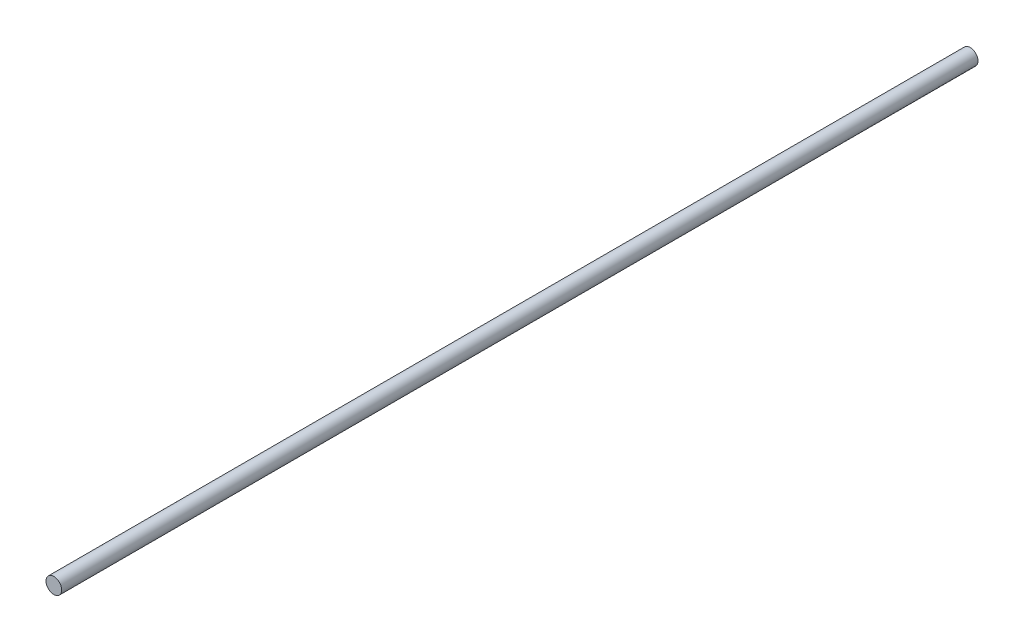
ISO-10303-21;
HEADER;
FILE_DESCRIPTION(('STEP AP214'),'2;1');
FILE_NAME('part.step','',(''),(''),'','','');
FILE_SCHEMA(('AUTOMOTIVE_DESIGN { 1 0 10303 214 1 1 1 1 }'));
ENDSEC;
DATA;
#1=APPLICATION_CONTEXT('core data for automotive mechanical design processes');
#2=APPLICATION_PROTOCOL_DEFINITION('international standard','automotive_design',2000,#1);
#3=PRODUCT_CONTEXT('',#1,'mechanical');
#4=PRODUCT('Part','Part','',(#3));
#5=PRODUCT_RELATED_PRODUCT_CATEGORY('part','',(#4));
#6=PRODUCT_DEFINITION_FORMATION('','',#4);
#7=PRODUCT_DEFINITION_CONTEXT('part definition',#1,'design');
#8=PRODUCT_DEFINITION('design','',#6,#7);
#9=PRODUCT_DEFINITION_SHAPE('','',#8);
#10=(LENGTH_UNIT() NAMED_UNIT(*) SI_UNIT(.MILLI.,.METRE.));
#11=(NAMED_UNIT(*) PLANE_ANGLE_UNIT() SI_UNIT($,.RADIAN.));
#12=(NAMED_UNIT(*) SI_UNIT($,.STERADIAN.) SOLID_ANGLE_UNIT());
#13=UNCERTAINTY_MEASURE_WITH_UNIT(LENGTH_MEASURE(1.E-05),#10,'distance_accuracy_value','');
#14=(GEOMETRIC_REPRESENTATION_CONTEXT(3) GLOBAL_UNCERTAINTY_ASSIGNED_CONTEXT((#13)) GLOBAL_UNIT_ASSIGNED_CONTEXT((#10,
#11,#12)) REPRESENTATION_CONTEXT('',''));
#15=CARTESIAN_POINT('',(0.,0.,0.));
#16=DIRECTION('',(0.,0.,1.));
#17=DIRECTION('',(1.,0.,0.));
#18=AXIS2_PLACEMENT_3D('',#15,#16,#17);
#19=CARTESIAN_POINT('',(0.,0.,370.84));
#20=DIRECTION('',(0.,0.,-1.));
#21=DIRECTION('',(-1.,0.,0.));
#22=AXIS2_PLACEMENT_3D('',#19,#20,#21);
#23=CYLINDRICAL_SURFACE('',#22,3.175);
#24=CARTESIAN_POINT('',(0.,0.,370.84));
#25=DIRECTION('',(0.,0.,1.));
#26=DIRECTION('',(1.,0.,0.));
#27=AXIS2_PLACEMENT_3D('',#24,#25,#26);
#28=CIRCLE('',#27,3.175);
#29=CARTESIAN_POINT('',(3.175,0.,370.84));
#30=VERTEX_POINT('',#29);
#31=EDGE_CURVE('E10',#30,#30,#28,.T.);
#32=ORIENTED_EDGE('',*,*,#31,.F.);
#33=EDGE_LOOP('',(#32));
#34=FACE_BOUND('',#33,.T.);
#35=CARTESIAN_POINT('',(0.,0.,0.));
#36=DIRECTION('',(0.,0.,1.));
#37=DIRECTION('',(1.,0.,0.));
#38=AXIS2_PLACEMENT_3D('',#35,#36,#37);
#39=CIRCLE('',#38,3.175);
#40=CARTESIAN_POINT('',(3.175,0.,0.));
#41=VERTEX_POINT('',#40);
#42=EDGE_CURVE('E35',#41,#41,#39,.T.);
#43=ORIENTED_EDGE('',*,*,#42,.T.);
#44=EDGE_LOOP('',(#43));
#45=FACE_BOUND('',#44,.T.);
#46=ADVANCED_FACE('F32',(#34,#45),#23,.T.);
#47=CARTESIAN_POINT('',(0.,0.,370.84));
#48=DIRECTION('',(0.,0.,1.));
#49=DIRECTION('',(1.,0.,0.));
#50=AXIS2_PLACEMENT_3D('',#47,#48,#49);
#51=PLANE('',#50);
#52=ORIENTED_EDGE('',*,*,#31,.T.);
#53=EDGE_LOOP('',(#52));
#54=FACE_BOUND('',#53,.T.);
#55=ADVANCED_FACE('F47',(#54),#51,.T.);
#56=CARTESIAN_POINT('',(0.,0.,0.));
#57=DIRECTION('',(0.,0.,1.));
#58=DIRECTION('',(1.,0.,0.));
#59=AXIS2_PLACEMENT_3D('',#56,#57,#58);
#60=PLANE('',#59);
#61=ORIENTED_EDGE('',*,*,#42,.F.);
#62=EDGE_LOOP('',(#61));
#63=FACE_BOUND('',#62,.T.);
#64=ADVANCED_FACE('F45',(#63),#60,.F.);
#65=CLOSED_SHELL('',(#46,#55,#64));
#66=MANIFOLD_SOLID_BREP('B2',#65);
#67=ADVANCED_BREP_SHAPE_REPRESENTATION('',(#18,#66),#14);
#68=SHAPE_DEFINITION_REPRESENTATION(#9,#67);
ENDSEC;
END-ISO-10303-21;
